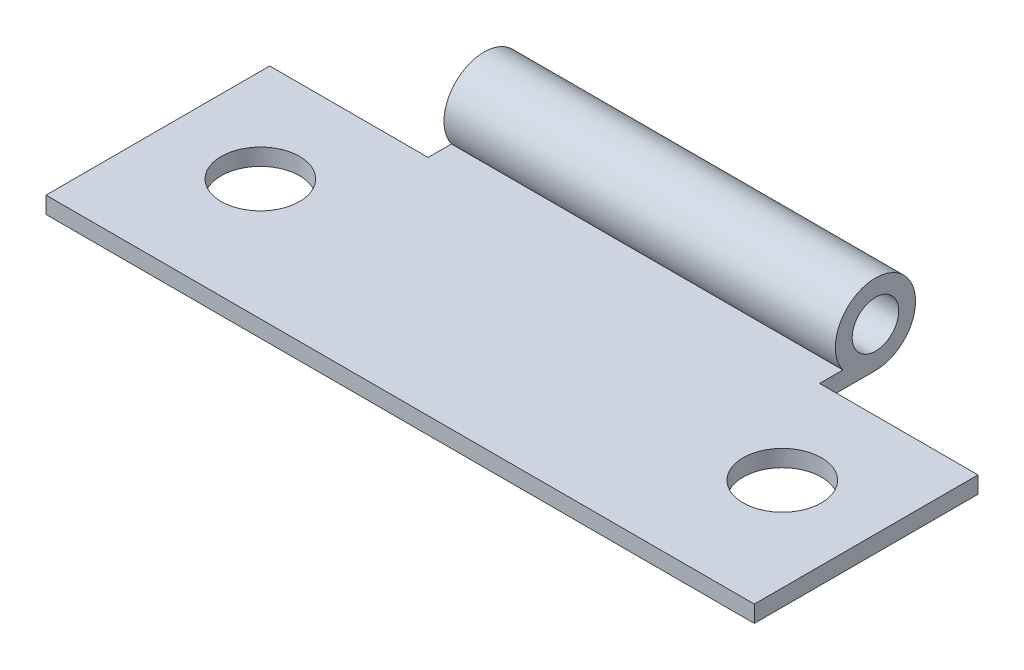
ISO-10303-21;
HEADER;
FILE_DESCRIPTION(('STEP AP214'),'2;1');
FILE_NAME('part.step','',(''),(''),'','','');
FILE_SCHEMA(('AUTOMOTIVE_DESIGN { 1 0 10303 214 1 1 1 1 }'));
ENDSEC;
DATA;
#1=APPLICATION_CONTEXT('core data for automotive mechanical design processes');
#2=APPLICATION_PROTOCOL_DEFINITION('international standard','automotive_design',2000,#1);
#3=PRODUCT_CONTEXT('',#1,'mechanical');
#4=PRODUCT('Part','Part','',(#3));
#5=PRODUCT_RELATED_PRODUCT_CATEGORY('part','',(#4));
#6=PRODUCT_DEFINITION_FORMATION('','',#4);
#7=PRODUCT_DEFINITION_CONTEXT('part definition',#1,'design');
#8=PRODUCT_DEFINITION('design','',#6,#7);
#9=PRODUCT_DEFINITION_SHAPE('','',#8);
#10=(LENGTH_UNIT() NAMED_UNIT(*) SI_UNIT(.MILLI.,.METRE.));
#11=(NAMED_UNIT(*) PLANE_ANGLE_UNIT() SI_UNIT($,.RADIAN.));
#12=(NAMED_UNIT(*) SI_UNIT($,.STERADIAN.) SOLID_ANGLE_UNIT());
#13=UNCERTAINTY_MEASURE_WITH_UNIT(LENGTH_MEASURE(1.E-05),#10,'distance_accuracy_value','');
#14=(GEOMETRIC_REPRESENTATION_CONTEXT(3) GLOBAL_UNCERTAINTY_ASSIGNED_CONTEXT((#13)) GLOBAL_UNIT_ASSIGNED_CONTEXT((#10,
#11,#12)) REPRESENTATION_CONTEXT('',''));
#15=CARTESIAN_POINT('',(0.,0.,0.));
#16=DIRECTION('',(0.,0.,1.));
#17=DIRECTION('',(1.,0.,0.));
#18=AXIS2_PLACEMENT_3D('',#15,#16,#17);
#19=CARTESIAN_POINT('',(38.,0.,0.));
#20=DIRECTION('',(1.,0.,0.));
#21=DIRECTION('',(0.,0.,-1.));
#22=AXIS2_PLACEMENT_3D('',#19,#20,#21);
#23=PLANE('',#22);
#24=DIRECTION('',(0.,1.,0.));
#25=VECTOR('',#24,1.);
#26=CARTESIAN_POINT('',(38.,-19.,2.99999999999999));
#27=LINE('',#26,#25);
#28=CARTESIAN_POINT('',(38.,-2.15,2.99999999999999));
#29=VERTEX_POINT('',#28);
#30=CARTESIAN_POINT('',(38.,-1.25,2.99999999999999));
#31=VERTEX_POINT('',#30);
#32=EDGE_CURVE('E117',#29,#31,#27,.T.);
#33=ORIENTED_EDGE('',*,*,#32,.T.);
#34=DIRECTION('',(0.,0.,1.));
#35=VECTOR('',#34,1.);
#36=CARTESIAN_POINT('',(38.,-1.25,1.74928556845359));
#37=LINE('',#36,#35);
#38=CARTESIAN_POINT('',(38.,-1.25,15.));
#39=VERTEX_POINT('',#38);
#40=EDGE_CURVE('E125',#31,#39,#37,.T.);
#41=ORIENTED_EDGE('',*,*,#40,.T.);
#42=DIRECTION('',(0.,-1.,0.));
#43=VECTOR('',#42,1.);
#44=CARTESIAN_POINT('',(38.,-2.15,15.));
#45=LINE('',#44,#43);
#46=CARTESIAN_POINT('',(38.,-2.15,15.));
#47=VERTEX_POINT('',#46);
#48=EDGE_CURVE('E128',#39,#47,#45,.T.);
#49=ORIENTED_EDGE('',*,*,#48,.T.);
#50=DIRECTION('',(0.,0.,-1.));
#51=VECTOR('',#50,1.);
#52=CARTESIAN_POINT('',(38.,-2.15,0.));
#53=LINE('',#52,#51);
#54=EDGE_CURVE('E136',#47,#29,#53,.T.);
#55=ORIENTED_EDGE('',*,*,#54,.T.);
#56=EDGE_LOOP('',(#33,#41,#49,#55));
#57=FACE_BOUND('',#56,.T.);
#58=ADVANCED_FACE('F36',(#57),#23,.T.);
#59=CARTESIAN_POINT('',(0.,0.,0.));
#60=DIRECTION('',(1.,0.,0.));
#61=DIRECTION('',(0.,0.,-1.));
#62=AXIS2_PLACEMENT_3D('',#59,#60,#61);
#63=PLANE('',#62);
#64=DIRECTION('',(0.,0.,1.));
#65=VECTOR('',#64,1.);
#66=CARTESIAN_POINT('',(0.,-1.25,1.74928556845359));
#67=LINE('',#66,#65);
#68=CARTESIAN_POINT('',(0.,-1.25,3.));
#69=VERTEX_POINT('',#68);
#70=CARTESIAN_POINT('',(0.,-1.25,15.));
#71=VERTEX_POINT('',#70);
#72=EDGE_CURVE('E116',#69,#71,#67,.T.);
#73=ORIENTED_EDGE('',*,*,#72,.F.);
#74=DIRECTION('',(0.,1.,0.));
#75=VECTOR('',#74,1.);
#76=CARTESIAN_POINT('',(0.,-19.,3.));
#77=LINE('',#76,#75);
#78=CARTESIAN_POINT('',(0.,-2.15,3.));
#79=VERTEX_POINT('',#78);
#80=EDGE_CURVE('E103',#79,#69,#77,.T.);
#81=ORIENTED_EDGE('',*,*,#80,.F.);
#82=DIRECTION('',(0.,0.,-1.));
#83=VECTOR('',#82,1.);
#84=CARTESIAN_POINT('',(0.,-2.15,0.));
#85=LINE('',#84,#83);
#86=CARTESIAN_POINT('',(0.,-2.15,15.));
#87=VERTEX_POINT('',#86);
#88=EDGE_CURVE('E115',#87,#79,#85,.T.);
#89=ORIENTED_EDGE('',*,*,#88,.F.);
#90=DIRECTION('',(0.,-1.,0.));
#91=VECTOR('',#90,1.);
#92=CARTESIAN_POINT('',(0.,-2.15,15.));
#93=LINE('',#92,#91);
#94=EDGE_CURVE('E126',#71,#87,#93,.T.);
#95=ORIENTED_EDGE('',*,*,#94,.F.);
#96=EDGE_LOOP('',(#73,#81,#89,#95));
#97=FACE_BOUND('',#96,.T.);
#98=ADVANCED_FACE('F113',(#97),#63,.F.);
#99=CARTESIAN_POINT('',(38.,0.,0.));
#100=DIRECTION('',(-1.,0.,0.));
#101=DIRECTION('',(0.,0.,1.));
#102=AXIS2_PLACEMENT_3D('',#99,#100,#101);
#103=CYLINDRICAL_SURFACE('',#102,2.15);
#104=DIRECTION('',(-1.,0.,0.));
#105=VECTOR('',#104,1.);
#106=CARTESIAN_POINT('',(38.,-1.25,1.74928556845359));
#107=LINE('',#106,#105);
#108=CARTESIAN_POINT('',(29.5,-1.25,1.74928556845359));
#109=VERTEX_POINT('',#108);
#110=CARTESIAN_POINT('',(8.5,-1.25,1.74928556845359));
#111=VERTEX_POINT('',#110);
#112=EDGE_CURVE('E108',#109,#111,#107,.T.);
#113=ORIENTED_EDGE('',*,*,#112,.F.);
#114=CARTESIAN_POINT('',(29.5,0.,0.));
#115=DIRECTION('',(-1.,0.,0.));
#116=DIRECTION('',(0.,0.,1.));
#117=AXIS2_PLACEMENT_3D('',#114,#115,#116);
#118=CIRCLE('',#117,2.15);
#119=CARTESIAN_POINT('',(29.5,-2.15,0.));
#120=VERTEX_POINT('',#119);
#121=EDGE_CURVE('E193',#109,#120,#118,.T.);
#122=ORIENTED_EDGE('',*,*,#121,.T.);
#123=DIRECTION('',(-1.,0.,0.));
#124=VECTOR('',#123,1.);
#125=CARTESIAN_POINT('',(38.,-2.15,0.));
#126=LINE('',#125,#124);
#127=CARTESIAN_POINT('',(8.5,-2.15,0.));
#128=VERTEX_POINT('',#127);
#129=EDGE_CURVE('E133',#120,#128,#126,.T.);
#130=ORIENTED_EDGE('',*,*,#129,.T.);
#131=CARTESIAN_POINT('',(8.5,0.,0.));
#132=DIRECTION('',(1.,0.,0.));
#133=DIRECTION('',(0.,0.,-1.));
#134=AXIS2_PLACEMENT_3D('',#131,#132,#133);
#135=CIRCLE('',#134,2.15);
#136=EDGE_CURVE('E188',#128,#111,#135,.T.);
#137=ORIENTED_EDGE('',*,*,#136,.T.);
#138=EDGE_LOOP('',(#113,#122,#130,#137));
#139=FACE_BOUND('',#138,.T.);
#140=ADVANCED_FACE('F38',(#139),#103,.T.);
#141=CARTESIAN_POINT('',(38.,-1.25,1.74928556845359));
#142=DIRECTION('',(0.,-1.,0.));
#143=DIRECTION('',(0.,0.,-1.));
#144=AXIS2_PLACEMENT_3D('',#141,#142,#143);
#145=PLANE('',#144);
#146=CARTESIAN_POINT('',(5.,-1.25,8.5));
#147=DIRECTION('',(0.,-1.,0.));
#148=DIRECTION('',(0.,0.,-1.));
#149=AXIS2_PLACEMENT_3D('',#146,#147,#148);
#150=CIRCLE('',#149,2.1);
#151=CARTESIAN_POINT('',(5.,-1.25,6.4));
#152=VERTEX_POINT('',#151);
#153=EDGE_CURVE('E169',#152,#152,#150,.T.);
#154=ORIENTED_EDGE('',*,*,#153,.T.);
#155=EDGE_LOOP('',(#154));
#156=FACE_BOUND('',#155,.T.);
#157=CARTESIAN_POINT('',(33.,-1.25,8.49999999999999));
#158=DIRECTION('',(0.,-1.,0.));
#159=DIRECTION('',(0.,0.,-1.));
#160=AXIS2_PLACEMENT_3D('',#157,#158,#159);
#161=CIRCLE('',#160,2.1);
#162=CARTESIAN_POINT('',(33.,-1.25,6.4));
#163=VERTEX_POINT('',#162);
#164=EDGE_CURVE('E153',#163,#163,#161,.T.);
#165=ORIENTED_EDGE('',*,*,#164,.T.);
#166=EDGE_LOOP('',(#165));
#167=FACE_BOUND('',#166,.T.);
#168=ORIENTED_EDGE('',*,*,#40,.F.);
#169=DIRECTION('',(-1.,0.,0.));
#170=VECTOR('',#169,1.);
#171=CARTESIAN_POINT('',(38.,-1.25,2.99999999999999));
#172=LINE('',#171,#170);
#173=CARTESIAN_POINT('',(29.5,-1.25,3.));
#174=VERTEX_POINT('',#173);
#175=EDGE_CURVE('E154',#31,#174,#172,.T.);
#176=ORIENTED_EDGE('',*,*,#175,.T.);
#177=DIRECTION('',(0.,0.,-1.));
#178=VECTOR('',#177,1.);
#179=CARTESIAN_POINT('',(29.5,-1.25,1.74928556845359));
#180=LINE('',#179,#178);
#181=EDGE_CURVE('E165',#174,#109,#180,.T.);
#182=ORIENTED_EDGE('',*,*,#181,.T.);
#183=ORIENTED_EDGE('',*,*,#112,.T.);
#184=DIRECTION('',(0.,0.,1.));
#185=VECTOR('',#184,1.);
#186=CARTESIAN_POINT('',(8.5,-1.25,1.7492855684536));
#187=LINE('',#186,#185);
#188=CARTESIAN_POINT('',(8.5,-1.25,3.));
#189=VERTEX_POINT('',#188);
#190=EDGE_CURVE('E150',#111,#189,#187,.T.);
#191=ORIENTED_EDGE('',*,*,#190,.T.);
#192=DIRECTION('',(-1.,0.,0.));
#193=VECTOR('',#192,1.);
#194=CARTESIAN_POINT('',(38.,-1.25,3.));
#195=LINE('',#194,#193);
#196=EDGE_CURVE('E160',#189,#69,#195,.T.);
#197=ORIENTED_EDGE('',*,*,#196,.T.);
#198=ORIENTED_EDGE('',*,*,#72,.T.);
#199=DIRECTION('',(-1.,0.,0.));
#200=VECTOR('',#199,1.);
#201=CARTESIAN_POINT('',(38.,-1.25,15.));
#202=LINE('',#201,#200);
#203=EDGE_CURVE('E138',#39,#71,#202,.T.);
#204=ORIENTED_EDGE('',*,*,#203,.F.);
#205=EDGE_LOOP('',(#168,#176,#182,#183,#191,#197,#198,#204));
#206=FACE_BOUND('',#205,.T.);
#207=ADVANCED_FACE('F175',(#156,#167,#206),#145,.F.);
#208=CARTESIAN_POINT('',(38.,-2.15,15.));
#209=DIRECTION('',(0.,0.,-1.));
#210=DIRECTION('',(-1.,0.,0.));
#211=AXIS2_PLACEMENT_3D('',#208,#209,#210);
#212=PLANE('',#211);
#213=ORIENTED_EDGE('',*,*,#94,.T.);
#214=DIRECTION('',(-1.,0.,0.));
#215=VECTOR('',#214,1.);
#216=CARTESIAN_POINT('',(38.,-2.15,15.));
#217=LINE('',#216,#215);
#218=EDGE_CURVE('E124',#47,#87,#217,.T.);
#219=ORIENTED_EDGE('',*,*,#218,.F.);
#220=ORIENTED_EDGE('',*,*,#48,.F.);
#221=ORIENTED_EDGE('',*,*,#203,.T.);
#222=EDGE_LOOP('',(#213,#219,#220,#221));
#223=FACE_BOUND('',#222,.T.);
#224=ADVANCED_FACE('F179',(#223),#212,.F.);
#225=CARTESIAN_POINT('',(38.,-2.15,0.));
#226=DIRECTION('',(0.,1.,0.));
#227=DIRECTION('',(0.,0.,1.));
#228=AXIS2_PLACEMENT_3D('',#225,#226,#227);
#229=PLANE('',#228);
#230=CARTESIAN_POINT('',(5.,-2.15,8.5));
#231=DIRECTION('',(0.,1.,0.));
#232=DIRECTION('',(0.,0.,1.));
#233=AXIS2_PLACEMENT_3D('',#230,#231,#232);
#234=CIRCLE('',#233,2.1);
#235=CARTESIAN_POINT('',(5.,-2.15,10.6));
#236=VERTEX_POINT('',#235);
#237=EDGE_CURVE('E40',#236,#236,#234,.T.);
#238=ORIENTED_EDGE('',*,*,#237,.T.);
#239=EDGE_LOOP('',(#238));
#240=FACE_BOUND('',#239,.T.);
#241=CARTESIAN_POINT('',(33.,-2.15,8.49999999999999));
#242=DIRECTION('',(0.,1.,0.));
#243=DIRECTION('',(0.,0.,1.));
#244=AXIS2_PLACEMENT_3D('',#241,#242,#243);
#245=CIRCLE('',#244,2.1);
#246=CARTESIAN_POINT('',(33.,-2.15,10.6));
#247=VERTEX_POINT('',#246);
#248=EDGE_CURVE('E151',#247,#247,#245,.T.);
#249=ORIENTED_EDGE('',*,*,#248,.T.);
#250=EDGE_LOOP('',(#249));
#251=FACE_BOUND('',#250,.T.);
#252=DIRECTION('',(0.,0.,1.));
#253=VECTOR('',#252,1.);
#254=CARTESIAN_POINT('',(29.5,-2.15,0.));
#255=LINE('',#254,#253);
#256=CARTESIAN_POINT('',(29.5,-2.15,3.));
#257=VERTEX_POINT('',#256);
#258=EDGE_CURVE('E149',#120,#257,#255,.T.);
#259=ORIENTED_EDGE('',*,*,#258,.T.);
#260=DIRECTION('',(1.,0.,0.));
#261=VECTOR('',#260,1.);
#262=CARTESIAN_POINT('',(38.,-2.15,2.99999999999999));
#263=LINE('',#262,#261);
#264=EDGE_CURVE('E11',#257,#29,#263,.T.);
#265=ORIENTED_EDGE('',*,*,#264,.T.);
#266=ORIENTED_EDGE('',*,*,#54,.F.);
#267=ORIENTED_EDGE('',*,*,#218,.T.);
#268=ORIENTED_EDGE('',*,*,#88,.T.);
#269=DIRECTION('',(1.,0.,0.));
#270=VECTOR('',#269,1.);
#271=CARTESIAN_POINT('',(38.,-2.15,3.));
#272=LINE('',#271,#270);
#273=CARTESIAN_POINT('',(8.5,-2.15,3.));
#274=VERTEX_POINT('',#273);
#275=EDGE_CURVE('E45',#79,#274,#272,.T.);
#276=ORIENTED_EDGE('',*,*,#275,.T.);
#277=DIRECTION('',(0.,0.,-1.));
#278=VECTOR('',#277,1.);
#279=CARTESIAN_POINT('',(8.5,-2.15,0.));
#280=LINE('',#279,#278);
#281=EDGE_CURVE('E146',#274,#128,#280,.T.);
#282=ORIENTED_EDGE('',*,*,#281,.T.);
#283=ORIENTED_EDGE('',*,*,#129,.F.);
#284=EDGE_LOOP('',(#259,#265,#266,#267,#268,#276,#282,#283));
#285=FACE_BOUND('',#284,.T.);
#286=ADVANCED_FACE('F121',(#240,#251,#285),#229,.F.);
#287=CARTESIAN_POINT('',(0.,-19.,3.));
#288=DIRECTION('',(0.,0.,1.));
#289=DIRECTION('',(1.,0.,0.));
#290=AXIS2_PLACEMENT_3D('',#287,#288,#289);
#291=PLANE('',#290);
#292=DIRECTION('',(0.,1.,0.));
#293=VECTOR('',#292,1.);
#294=CARTESIAN_POINT('',(8.5,-19.,3.));
#295=LINE('',#294,#293);
#296=EDGE_CURVE('E61',#274,#189,#295,.T.);
#297=ORIENTED_EDGE('',*,*,#296,.F.);
#298=ORIENTED_EDGE('',*,*,#275,.F.);
#299=ORIENTED_EDGE('',*,*,#80,.T.);
#300=ORIENTED_EDGE('',*,*,#196,.F.);
#301=EDGE_LOOP('',(#297,#298,#299,#300));
#302=FACE_BOUND('',#301,.T.);
#303=ADVANCED_FACE('F102',(#302),#291,.F.);
#304=CARTESIAN_POINT('',(8.5,-19.,-5.89013019203827));
#305=DIRECTION('',(1.,0.,0.));
#306=DIRECTION('',(0.,0.,-1.));
#307=AXIS2_PLACEMENT_3D('',#304,#305,#306);
#308=PLANE('',#307);
#309=CARTESIAN_POINT('',(8.5,0.,0.));
#310=DIRECTION('',(1.,0.,0.));
#311=DIRECTION('',(0.,0.,-1.));
#312=AXIS2_PLACEMENT_3D('',#309,#310,#311);
#313=CIRCLE('',#312,1.25);
#314=CARTESIAN_POINT('',(8.5,0.,-1.25));
#315=VERTEX_POINT('',#314);
#316=EDGE_CURVE('E143',#315,#315,#313,.T.);
#317=ORIENTED_EDGE('',*,*,#316,.T.);
#318=EDGE_LOOP('',(#317));
#319=FACE_BOUND('',#318,.T.);
#320=ORIENTED_EDGE('',*,*,#136,.F.);
#321=ORIENTED_EDGE('',*,*,#281,.F.);
#322=ORIENTED_EDGE('',*,*,#296,.T.);
#323=ORIENTED_EDGE('',*,*,#190,.F.);
#324=EDGE_LOOP('',(#320,#321,#322,#323));
#325=FACE_BOUND('',#324,.T.);
#326=ADVANCED_FACE('F199',(#319,#325),#308,.F.);
#327=CARTESIAN_POINT('',(38.,-19.,2.99999999999999));
#328=DIRECTION('',(0.,0.,1.));
#329=DIRECTION('',(1.,0.,0.));
#330=AXIS2_PLACEMENT_3D('',#327,#328,#329);
#331=PLANE('',#330);
#332=ORIENTED_EDGE('',*,*,#32,.F.);
#333=ORIENTED_EDGE('',*,*,#264,.F.);
#334=DIRECTION('',(0.,1.,0.));
#335=VECTOR('',#334,1.);
#336=CARTESIAN_POINT('',(29.5,-19.,3.));
#337=LINE('',#336,#335);
#338=EDGE_CURVE('E53',#257,#174,#337,.T.);
#339=ORIENTED_EDGE('',*,*,#338,.T.);
#340=ORIENTED_EDGE('',*,*,#175,.F.);
#341=EDGE_LOOP('',(#332,#333,#339,#340));
#342=FACE_BOUND('',#341,.T.);
#343=ADVANCED_FACE('F203',(#342),#331,.F.);
#344=CARTESIAN_POINT('',(29.5,-19.,-5.89013019203827));
#345=DIRECTION('',(-1.,0.,0.));
#346=DIRECTION('',(0.,0.,1.));
#347=AXIS2_PLACEMENT_3D('',#344,#345,#346);
#348=PLANE('',#347);
#349=CARTESIAN_POINT('',(29.5,0.,0.));
#350=DIRECTION('',(-1.,0.,0.));
#351=DIRECTION('',(0.,0.,1.));
#352=AXIS2_PLACEMENT_3D('',#349,#350,#351);
#353=CIRCLE('',#352,1.25);
#354=CARTESIAN_POINT('',(29.5,0.,1.25));
#355=VERTEX_POINT('',#354);
#356=EDGE_CURVE('E147',#355,#355,#353,.T.);
#357=ORIENTED_EDGE('',*,*,#356,.T.);
#358=EDGE_LOOP('',(#357));
#359=FACE_BOUND('',#358,.T.);
#360=ORIENTED_EDGE('',*,*,#338,.F.);
#361=ORIENTED_EDGE('',*,*,#258,.F.);
#362=ORIENTED_EDGE('',*,*,#121,.F.);
#363=ORIENTED_EDGE('',*,*,#181,.F.);
#364=EDGE_LOOP('',(#360,#361,#362,#363));
#365=FACE_BOUND('',#364,.T.);
#366=ADVANCED_FACE('F200',(#359,#365),#348,.F.);
#367=CARTESIAN_POINT('',(33.,-19.,8.49999999999999));
#368=DIRECTION('',(0.,1.,0.));
#369=DIRECTION('',(0.,0.,1.));
#370=AXIS2_PLACEMENT_3D('',#367,#368,#369);
#371=CYLINDRICAL_SURFACE('',#370,2.1);
#372=ORIENTED_EDGE('',*,*,#248,.F.);
#373=EDGE_LOOP('',(#372));
#374=FACE_BOUND('',#373,.T.);
#375=ORIENTED_EDGE('',*,*,#164,.F.);
#376=EDGE_LOOP('',(#375));
#377=FACE_BOUND('',#376,.T.);
#378=ADVANCED_FACE('F202',(#374,#377),#371,.F.);
#379=CARTESIAN_POINT('',(5.,-19.,8.5));
#380=DIRECTION('',(0.,1.,0.));
#381=DIRECTION('',(0.,0.,1.));
#382=AXIS2_PLACEMENT_3D('',#379,#380,#381);
#383=CYLINDRICAL_SURFACE('',#382,2.1);
#384=ORIENTED_EDGE('',*,*,#237,.F.);
#385=EDGE_LOOP('',(#384));
#386=FACE_BOUND('',#385,.T.);
#387=ORIENTED_EDGE('',*,*,#153,.F.);
#388=EDGE_LOOP('',(#387));
#389=FACE_BOUND('',#388,.T.);
#390=ADVANCED_FACE('F210',(#386,#389),#383,.F.);
#391=CARTESIAN_POINT('',(38.,0.,0.));
#392=DIRECTION('',(-1.,0.,0.));
#393=DIRECTION('',(0.,0.,1.));
#394=AXIS2_PLACEMENT_3D('',#391,#392,#393);
#395=CYLINDRICAL_SURFACE('',#394,1.25);
#396=ORIENTED_EDGE('',*,*,#356,.F.);
#397=EDGE_LOOP('',(#396));
#398=FACE_BOUND('',#397,.T.);
#399=ORIENTED_EDGE('',*,*,#316,.F.);
#400=EDGE_LOOP('',(#399));
#401=FACE_BOUND('',#400,.T.);
#402=ADVANCED_FACE('F221',(#398,#401),#395,.F.);
#403=CLOSED_SHELL('',(#58,#98,#140,#207,#224,#286,#303,#326,#343,#366,#378,#390,#402));
#404=MANIFOLD_SOLID_BREP('B2',#403);
#405=ADVANCED_BREP_SHAPE_REPRESENTATION('',(#18,#404),#14);
#406=SHAPE_DEFINITION_REPRESENTATION(#9,#405);
ENDSEC;
END-ISO-10303-21;
